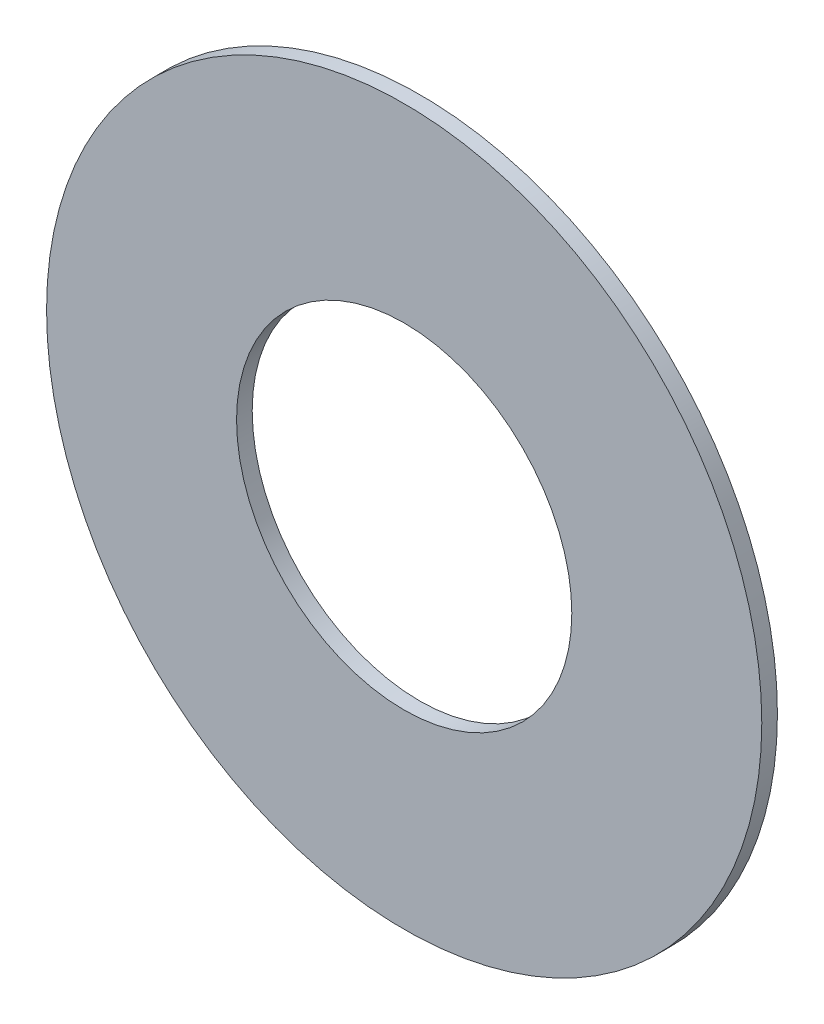
ISO-10303-21;
HEADER;
FILE_DESCRIPTION(('STEP AP214'),'2;1');
FILE_NAME('part.step','',(''),(''),'','','');
FILE_SCHEMA(('AUTOMOTIVE_DESIGN { 1 0 10303 214 1 1 1 1 }'));
ENDSEC;
DATA;
#1=APPLICATION_CONTEXT('core data for automotive mechanical design processes');
#2=APPLICATION_PROTOCOL_DEFINITION('international standard','automotive_design',2000,#1);
#3=PRODUCT_CONTEXT('',#1,'mechanical');
#4=PRODUCT('Part','Part','',(#3));
#5=PRODUCT_RELATED_PRODUCT_CATEGORY('part','',(#4));
#6=PRODUCT_DEFINITION_FORMATION('','',#4);
#7=PRODUCT_DEFINITION_CONTEXT('part definition',#1,'design');
#8=PRODUCT_DEFINITION('design','',#6,#7);
#9=PRODUCT_DEFINITION_SHAPE('','',#8);
#10=(LENGTH_UNIT() NAMED_UNIT(*) SI_UNIT(.MILLI.,.METRE.));
#11=(NAMED_UNIT(*) PLANE_ANGLE_UNIT() SI_UNIT($,.RADIAN.));
#12=(NAMED_UNIT(*) SI_UNIT($,.STERADIAN.) SOLID_ANGLE_UNIT());
#13=UNCERTAINTY_MEASURE_WITH_UNIT(LENGTH_MEASURE(1.E-05),#10,'distance_accuracy_value','');
#14=(GEOMETRIC_REPRESENTATION_CONTEXT(3) GLOBAL_UNCERTAINTY_ASSIGNED_CONTEXT((#13)) GLOBAL_UNIT_ASSIGNED_CONTEXT((#10,
#11,#12)) REPRESENTATION_CONTEXT('',''));
#15=CARTESIAN_POINT('',(0.,0.,0.));
#16=DIRECTION('',(0.,0.,1.));
#17=DIRECTION('',(1.,0.,0.));
#18=AXIS2_PLACEMENT_3D('',#15,#16,#17);
#19=CARTESIAN_POINT('',(170.307,-133.477,-0.045));
#20=DIRECTION('',(0.,0.,-1.));
#21=DIRECTION('',(0.,-1.,0.));
#22=AXIS2_PLACEMENT_3D('',#19,#20,#21);
#23=CYLINDRICAL_SURFACE('',#22,0.375);
#24=CARTESIAN_POINT('',(170.307,-133.477,1.67));
#25=DIRECTION('',(0.,0.,-1.));
#26=DIRECTION('',(0.,-1.,0.));
#27=AXIS2_PLACEMENT_3D('',#24,#25,#26);
#28=CIRCLE('',#27,0.375);
#29=CARTESIAN_POINT('',(170.307,-133.852,1.67));
#30=VERTEX_POINT('',#29);
#31=EDGE_CURVE('E25',#30,#30,#28,.T.);
#32=ORIENTED_EDGE('',*,*,#31,.T.);
#33=DIRECTION('',(0.,0.,1.));
#34=VECTOR('',#33,1.);
#35=CARTESIAN_POINT('',(170.307,-133.852,-0.045));
#36=LINE('',#35,#34);
#37=CARTESIAN_POINT('',(170.307,-133.852,1.705));
#38=VERTEX_POINT('',#37);
#39=EDGE_CURVE('E11',#30,#38,#36,.T.);
#40=ORIENTED_EDGE('',*,*,#39,.T.);
#41=CARTESIAN_POINT('',(170.307,-133.477,1.705));
#42=DIRECTION('',(0.,0.,-1.));
#43=DIRECTION('',(0.,-1.,0.));
#44=AXIS2_PLACEMENT_3D('',#41,#42,#43);
#45=CIRCLE('',#44,0.375);
#46=EDGE_CURVE('E69',#38,#38,#45,.T.);
#47=ORIENTED_EDGE('',*,*,#46,.F.);
#48=ORIENTED_EDGE('',*,*,#39,.F.);
#49=EDGE_LOOP('',(#32,#40,#47,#48));
#50=FACE_BOUND('',#49,.T.);
#51=ADVANCED_FACE('F17',(#50),#23,.F.);
#52=CARTESIAN_POINT('',(170.307,-133.477,1.67));
#53=DIRECTION('',(0.,0.,1.));
#54=DIRECTION('',(1.,0.,0.));
#55=AXIS2_PLACEMENT_3D('',#52,#53,#54);
#56=PLANE('',#55);
#57=ORIENTED_EDGE('',*,*,#31,.F.);
#58=EDGE_LOOP('',(#57));
#59=FACE_BOUND('',#58,.T.);
#60=CARTESIAN_POINT('',(170.307,-133.477,1.67));
#61=DIRECTION('',(0.,0.,1.));
#62=DIRECTION('',(1.,0.,0.));
#63=AXIS2_PLACEMENT_3D('',#60,#61,#62);
#64=CIRCLE('',#63,0.8);
#65=CARTESIAN_POINT('',(171.107,-133.477,1.67));
#66=VERTEX_POINT('',#65);
#67=EDGE_CURVE('E56',#66,#66,#64,.T.);
#68=ORIENTED_EDGE('',*,*,#67,.F.);
#69=EDGE_LOOP('',(#68));
#70=FACE_BOUND('',#69,.T.);
#71=ADVANCED_FACE('F76',(#59,#70),#56,.F.);
#72=CARTESIAN_POINT('',(170.307,-133.477,1.705));
#73=DIRECTION('',(0.,0.,1.));
#74=DIRECTION('',(1.,0.,0.));
#75=AXIS2_PLACEMENT_3D('',#72,#73,#74);
#76=PLANE('',#75);
#77=ORIENTED_EDGE('',*,*,#46,.T.);
#78=EDGE_LOOP('',(#77));
#79=FACE_BOUND('',#78,.T.);
#80=CARTESIAN_POINT('',(170.307,-133.477,1.705));
#81=DIRECTION('',(0.,0.,1.));
#82=DIRECTION('',(1.,0.,0.));
#83=AXIS2_PLACEMENT_3D('',#80,#81,#82);
#84=CIRCLE('',#83,0.8);
#85=CARTESIAN_POINT('',(171.107,-133.477,1.705));
#86=VERTEX_POINT('',#85);
#87=EDGE_CURVE('E54',#86,#86,#84,.T.);
#88=ORIENTED_EDGE('',*,*,#87,.T.);
#89=EDGE_LOOP('',(#88));
#90=FACE_BOUND('',#89,.T.);
#91=ADVANCED_FACE('F60',(#79,#90),#76,.T.);
#92=CARTESIAN_POINT('',(170.307,-133.477,1.67));
#93=DIRECTION('',(0.,0.,1.));
#94=DIRECTION('',(1.,0.,0.));
#95=AXIS2_PLACEMENT_3D('',#92,#93,#94);
#96=CYLINDRICAL_SURFACE('',#95,0.8);
#97=ORIENTED_EDGE('',*,*,#87,.F.);
#98=DIRECTION('',(0.,0.,1.));
#99=VECTOR('',#98,1.);
#100=CARTESIAN_POINT('',(171.107,-133.477,1.67));
#101=LINE('',#100,#99);
#102=EDGE_CURVE('E51',#66,#86,#101,.T.);
#103=ORIENTED_EDGE('',*,*,#102,.F.);
#104=ORIENTED_EDGE('',*,*,#67,.T.);
#105=ORIENTED_EDGE('',*,*,#102,.T.);
#106=EDGE_LOOP('',(#97,#103,#104,#105));
#107=FACE_BOUND('',#106,.T.);
#108=ADVANCED_FACE('F53',(#107),#96,.T.);
#109=CLOSED_SHELL('',(#51,#71,#91,#108));
#110=MANIFOLD_SOLID_BREP('B1',#109);
#111=ADVANCED_BREP_SHAPE_REPRESENTATION('',(#18,#110),#14);
#112=SHAPE_DEFINITION_REPRESENTATION(#9,#111);
ENDSEC;
END-ISO-10303-21;
